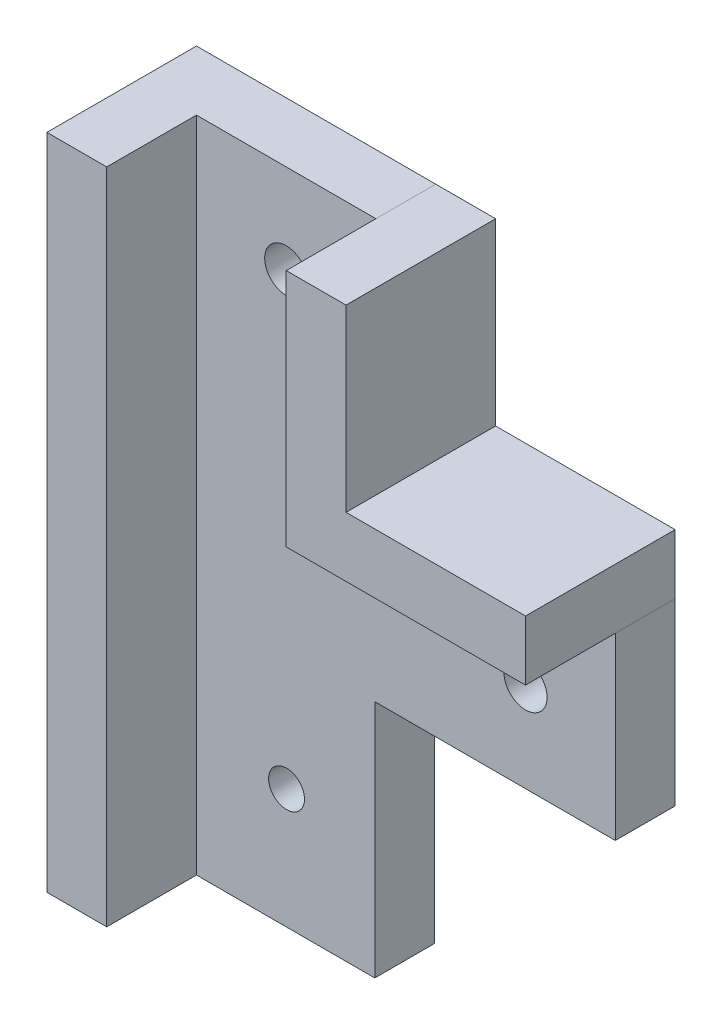
ISO-10303-21;
HEADER;
FILE_DESCRIPTION(('STEP AP214'),'2;1');
FILE_NAME('part.step','',(''),(''),'','','');
FILE_SCHEMA(('AUTOMOTIVE_DESIGN { 1 0 10303 214 1 1 1 1 }'));
ENDSEC;
DATA;
#1=APPLICATION_CONTEXT('core data for automotive mechanical design processes');
#2=APPLICATION_PROTOCOL_DEFINITION('international standard','automotive_design',2000,#1);
#3=PRODUCT_CONTEXT('',#1,'mechanical');
#4=PRODUCT('Part','Part','',(#3));
#5=PRODUCT_RELATED_PRODUCT_CATEGORY('part','',(#4));
#6=PRODUCT_DEFINITION_FORMATION('','',#4);
#7=PRODUCT_DEFINITION_CONTEXT('part definition',#1,'design');
#8=PRODUCT_DEFINITION('design','',#6,#7);
#9=PRODUCT_DEFINITION_SHAPE('','',#8);
#10=(LENGTH_UNIT() NAMED_UNIT(*) SI_UNIT(.MILLI.,.METRE.));
#11=(NAMED_UNIT(*) PLANE_ANGLE_UNIT() SI_UNIT($,.RADIAN.));
#12=(NAMED_UNIT(*) SI_UNIT($,.STERADIAN.) SOLID_ANGLE_UNIT());
#13=UNCERTAINTY_MEASURE_WITH_UNIT(LENGTH_MEASURE(1.E-05),#10,'distance_accuracy_value','');
#14=(GEOMETRIC_REPRESENTATION_CONTEXT(3) GLOBAL_UNCERTAINTY_ASSIGNED_CONTEXT((#13)) GLOBAL_UNIT_ASSIGNED_CONTEXT((#10,
#11,#12)) REPRESENTATION_CONTEXT('',''));
#15=CARTESIAN_POINT('',(0.,0.,0.));
#16=DIRECTION('',(0.,0.,1.));
#17=DIRECTION('',(1.,0.,0.));
#18=AXIS2_PLACEMENT_3D('',#15,#16,#17);
#19=CARTESIAN_POINT('',(-7.52988047808764,9.19322709163348,12.5));
#20=DIRECTION('',(0.,1.,0.));
#21=DIRECTION('',(0.,0.,1.));
#22=AXIS2_PLACEMENT_3D('',#19,#20,#21);
#23=PLANE('',#22);
#24=DIRECTION('',(1.,0.,0.));
#25=VECTOR('',#24,1.);
#26=CARTESIAN_POINT('',(-7.52988047808764,9.19322709163348,0.));
#27=LINE('',#26,#25);
#28=CARTESIAN_POINT('',(-12.5298804780876,9.19322709163348,0.));
#29=VERTEX_POINT('',#28);
#30=CARTESIAN_POINT('',(7.47011952191236,9.19322709163348,0.));
#31=VERTEX_POINT('',#30);
#32=EDGE_CURVE('E216',#29,#31,#27,.T.);
#33=ORIENTED_EDGE('',*,*,#32,.F.);
#34=DIRECTION('',(0.,0.,-1.));
#35=VECTOR('',#34,1.);
#36=CARTESIAN_POINT('',(-12.5298804780876,9.19322709163348,12.5));
#37=LINE('',#36,#35);
#38=CARTESIAN_POINT('',(-12.5298804780876,9.19322709163348,12.5));
#39=VERTEX_POINT('',#38);
#40=EDGE_CURVE('E59',#39,#29,#37,.T.);
#41=ORIENTED_EDGE('',*,*,#40,.F.);
#42=DIRECTION('',(1.,0.,0.));
#43=VECTOR('',#42,1.);
#44=CARTESIAN_POINT('',(-7.52988047808764,9.19322709163348,12.5));
#45=LINE('',#44,#43);
#46=CARTESIAN_POINT('',(-7.52988047808764,9.19322709163348,12.5));
#47=VERTEX_POINT('',#46);
#48=EDGE_CURVE('E223',#39,#47,#45,.T.);
#49=ORIENTED_EDGE('',*,*,#48,.T.);
#50=DIRECTION('',(0.,0.,-1.));
#51=VECTOR('',#50,1.);
#52=CARTESIAN_POINT('',(-7.52988047808764,9.19322709163348,12.5));
#53=LINE('',#52,#51);
#54=CARTESIAN_POINT('',(-7.52988047808764,9.19322709163348,5.));
#55=VERTEX_POINT('',#54);
#56=EDGE_CURVE('E12',#47,#55,#53,.T.);
#57=ORIENTED_EDGE('',*,*,#56,.T.);
#58=DIRECTION('',(-1.,0.,0.));
#59=VECTOR('',#58,1.);
#60=CARTESIAN_POINT('',(-7.52988047808764,9.19322709163348,5.));
#61=LINE('',#60,#59);
#62=CARTESIAN_POINT('',(7.47011952191236,9.19322709163348,5.));
#63=VERTEX_POINT('',#62);
#64=EDGE_CURVE('E168',#63,#55,#61,.T.);
#65=ORIENTED_EDGE('',*,*,#64,.F.);
#66=DIRECTION('',(0.,0.,-1.));
#67=VECTOR('',#66,1.);
#68=CARTESIAN_POINT('',(7.47011952191236,9.19322709163348,5.));
#69=LINE('',#68,#67);
#70=EDGE_CURVE('E172',#63,#31,#69,.T.);
#71=ORIENTED_EDGE('',*,*,#70,.T.);
#72=EDGE_LOOP('',(#33,#41,#49,#57,#65,#71));
#73=FACE_BOUND('',#72,.T.);
#74=ADVANCED_FACE('F49',(#73),#23,.T.);
#75=CARTESIAN_POINT('',(-12.5298804780876,-45.8067729083665,12.5));
#76=DIRECTION('',(-1.,0.,0.));
#77=DIRECTION('',(0.,0.,1.));
#78=AXIS2_PLACEMENT_3D('',#75,#76,#77);
#79=PLANE('',#78);
#80=DIRECTION('',(0.,1.,0.));
#81=VECTOR('',#80,1.);
#82=CARTESIAN_POINT('',(-12.5298804780876,-45.8067729083665,0.));
#83=LINE('',#82,#81);
#84=CARTESIAN_POINT('',(-12.5298804780876,-45.8067729083665,0.));
#85=VERTEX_POINT('',#84);
#86=EDGE_CURVE('E230',#85,#29,#83,.T.);
#87=ORIENTED_EDGE('',*,*,#86,.F.);
#88=DIRECTION('',(0.,0.,-1.));
#89=VECTOR('',#88,1.);
#90=CARTESIAN_POINT('',(-12.5298804780876,-45.8067729083665,12.5));
#91=LINE('',#90,#89);
#92=CARTESIAN_POINT('',(-12.5298804780876,-45.8067729083665,12.5));
#93=VERTEX_POINT('',#92);
#94=EDGE_CURVE('E236',#93,#85,#91,.T.);
#95=ORIENTED_EDGE('',*,*,#94,.F.);
#96=DIRECTION('',(0.,1.,0.));
#97=VECTOR('',#96,1.);
#98=CARTESIAN_POINT('',(-12.5298804780876,-45.8067729083665,12.5));
#99=LINE('',#98,#97);
#100=EDGE_CURVE('E220',#93,#39,#99,.T.);
#101=ORIENTED_EDGE('',*,*,#100,.T.);
#102=ORIENTED_EDGE('',*,*,#40,.T.);
#103=EDGE_LOOP('',(#87,#95,#101,#102));
#104=FACE_BOUND('',#103,.T.);
#105=ADVANCED_FACE('F244',(#104),#79,.T.);
#106=CARTESIAN_POINT('',(-7.52988047808764,-45.8067729083665,12.5));
#107=DIRECTION('',(0.,-1.,0.));
#108=DIRECTION('',(0.,0.,-1.));
#109=AXIS2_PLACEMENT_3D('',#106,#107,#108);
#110=PLANE('',#109);
#111=DIRECTION('',(-1.,0.,0.));
#112=VECTOR('',#111,1.);
#113=CARTESIAN_POINT('',(-7.52988047808764,-45.8067729083665,0.));
#114=LINE('',#113,#112);
#115=CARTESIAN_POINT('',(7.37011952191236,-45.8067729083665,0.));
#116=VERTEX_POINT('',#115);
#117=EDGE_CURVE('E210',#116,#85,#114,.T.);
#118=ORIENTED_EDGE('',*,*,#117,.F.);
#119=DIRECTION('',(0.,0.,1.));
#120=VECTOR('',#119,1.);
#121=CARTESIAN_POINT('',(7.37011952191236,-45.8067729083665,0.));
#122=LINE('',#121,#120);
#123=CARTESIAN_POINT('',(7.37011952191236,-45.8067729083665,5.));
#124=VERTEX_POINT('',#123);
#125=EDGE_CURVE('E198',#116,#124,#122,.T.);
#126=ORIENTED_EDGE('',*,*,#125,.T.);
#127=DIRECTION('',(1.,0.,0.));
#128=VECTOR('',#127,1.);
#129=CARTESIAN_POINT('',(-7.52988047808764,-45.8067729083665,5.));
#130=LINE('',#129,#128);
#131=CARTESIAN_POINT('',(-7.52988047808764,-45.8067729083665,5.));
#132=VERTEX_POINT('',#131);
#133=EDGE_CURVE('E202',#132,#124,#130,.T.);
#134=ORIENTED_EDGE('',*,*,#133,.F.);
#135=DIRECTION('',(0.,0.,-1.));
#136=VECTOR('',#135,1.);
#137=CARTESIAN_POINT('',(-7.52988047808764,-45.8067729083665,12.5));
#138=LINE('',#137,#136);
#139=CARTESIAN_POINT('',(-7.52988047808764,-45.8067729083665,12.5));
#140=VERTEX_POINT('',#139);
#141=EDGE_CURVE('E53',#140,#132,#138,.T.);
#142=ORIENTED_EDGE('',*,*,#141,.F.);
#143=DIRECTION('',(-1.,0.,0.));
#144=VECTOR('',#143,1.);
#145=CARTESIAN_POINT('',(-7.52988047808764,-45.8067729083665,12.5));
#146=LINE('',#145,#144);
#147=EDGE_CURVE('E215',#140,#93,#146,.T.);
#148=ORIENTED_EDGE('',*,*,#147,.T.);
#149=ORIENTED_EDGE('',*,*,#94,.T.);
#150=EDGE_LOOP('',(#118,#126,#134,#142,#148,#149));
#151=FACE_BOUND('',#150,.T.);
#152=ADVANCED_FACE('F240',(#151),#110,.T.);
#153=CARTESIAN_POINT('',(-7.52988047808764,-25.8067729083665,12.5));
#154=DIRECTION('',(1.,0.,0.));
#155=DIRECTION('',(0.,0.,-1.));
#156=AXIS2_PLACEMENT_3D('',#153,#154,#155);
#157=PLANE('',#156);
#158=DIRECTION('',(0.,-1.,0.));
#159=VECTOR('',#158,1.);
#160=CARTESIAN_POINT('',(-7.52988047808764,-25.8067729083665,5.));
#161=LINE('',#160,#159);
#162=EDGE_CURVE('E152',#55,#132,#161,.T.);
#163=ORIENTED_EDGE('',*,*,#162,.F.);
#164=ORIENTED_EDGE('',*,*,#56,.F.);
#165=DIRECTION('',(0.,-1.,0.));
#166=VECTOR('',#165,1.);
#167=CARTESIAN_POINT('',(-7.52988047808764,-25.8067729083665,12.5));
#168=LINE('',#167,#166);
#169=EDGE_CURVE('E88',#47,#140,#168,.T.);
#170=ORIENTED_EDGE('',*,*,#169,.T.);
#171=ORIENTED_EDGE('',*,*,#141,.T.);
#172=EDGE_LOOP('',(#163,#164,#170,#171));
#173=FACE_BOUND('',#172,.T.);
#174=ADVANCED_FACE('F51',(#173),#157,.T.);
#175=CARTESIAN_POINT('',(0.,0.,12.5));
#176=DIRECTION('',(0.,0.,1.));
#177=DIRECTION('',(1.,0.,0.));
#178=AXIS2_PLACEMENT_3D('',#175,#176,#177);
#179=PLANE('',#178);
#180=ORIENTED_EDGE('',*,*,#169,.F.);
#181=ORIENTED_EDGE('',*,*,#48,.F.);
#182=ORIENTED_EDGE('',*,*,#100,.F.);
#183=ORIENTED_EDGE('',*,*,#147,.F.);
#184=EDGE_LOOP('',(#180,#181,#182,#183));
#185=FACE_BOUND('',#184,.T.);
#186=ADVANCED_FACE('F254',(#185),#179,.T.);
#187=CARTESIAN_POINT('',(0.,0.,0.));
#188=DIRECTION('',(0.,0.,1.));
#189=DIRECTION('',(1.,0.,0.));
#190=AXIS2_PLACEMENT_3D('',#187,#188,#189);
#191=PLANE('',#190);
#192=CARTESIAN_POINT('',(0.,-35.8067729083665,0.));
#193=DIRECTION('',(0.,0.,1.));
#194=DIRECTION('',(1.,0.,0.));
#195=AXIS2_PLACEMENT_3D('',#192,#193,#194);
#196=CIRCLE('',#195,1.5);
#197=CARTESIAN_POINT('',(1.5,-35.8067729083665,0.));
#198=VERTEX_POINT('',#197);
#199=EDGE_CURVE('E305',#198,#198,#196,.T.);
#200=ORIENTED_EDGE('',*,*,#199,.T.);
#201=EDGE_LOOP('',(#200));
#202=FACE_BOUND('',#201,.T.);
#203=ORIENTED_EDGE('',*,*,#32,.T.);
#204=DIRECTION('',(0.,1.,0.));
#205=VECTOR('',#204,1.);
#206=CARTESIAN_POINT('',(7.47011952191236,9.19322709163348,0.));
#207=LINE('',#206,#205);
#208=CARTESIAN_POINT('',(7.47011952191236,-10.8067729083665,0.));
#209=VERTEX_POINT('',#208);
#210=EDGE_CURVE('E142',#209,#31,#207,.T.);
#211=ORIENTED_EDGE('',*,*,#210,.F.);
#212=DIRECTION('',(-1.,0.,0.));
#213=VECTOR('',#212,1.);
#214=CARTESIAN_POINT('',(27.4701195219124,-10.8067729083665,0.));
#215=LINE('',#214,#213);
#216=CARTESIAN_POINT('',(27.4701195219124,-10.8067729083665,0.));
#217=VERTEX_POINT('',#216);
#218=EDGE_CURVE('E179',#217,#209,#215,.T.);
#219=ORIENTED_EDGE('',*,*,#218,.F.);
#220=DIRECTION('',(0.,1.,0.));
#221=VECTOR('',#220,1.);
#222=CARTESIAN_POINT('',(27.4701195219124,-25.8067729083665,0.));
#223=LINE('',#222,#221);
#224=CARTESIAN_POINT('',(27.4701195219124,-25.8067729083665,0.));
#225=VERTEX_POINT('',#224);
#226=EDGE_CURVE('E175',#225,#217,#223,.T.);
#227=ORIENTED_EDGE('',*,*,#226,.F.);
#228=DIRECTION('',(1.,0.,0.));
#229=VECTOR('',#228,1.);
#230=CARTESIAN_POINT('',(7.37011952191236,-25.8067729083665,0.));
#231=LINE('',#230,#229);
#232=CARTESIAN_POINT('',(7.37011952191236,-25.8067729083665,0.));
#233=VERTEX_POINT('',#232);
#234=EDGE_CURVE('E148',#233,#225,#231,.T.);
#235=ORIENTED_EDGE('',*,*,#234,.F.);
#236=DIRECTION('',(0.,1.,0.));
#237=VECTOR('',#236,1.);
#238=CARTESIAN_POINT('',(7.37011952191236,-45.8067729083665,0.));
#239=LINE('',#238,#237);
#240=EDGE_CURVE('E194',#116,#233,#239,.T.);
#241=ORIENTED_EDGE('',*,*,#240,.F.);
#242=ORIENTED_EDGE('',*,*,#117,.T.);
#243=ORIENTED_EDGE('',*,*,#86,.T.);
#244=EDGE_LOOP('',(#203,#211,#219,#227,#235,#241,#242,#243));
#245=FACE_BOUND('',#244,.T.);
#246=CARTESIAN_POINT('',(-0.0298804780876419,1.69322709163348,0.));
#247=DIRECTION('',(0.,0.,-1.));
#248=DIRECTION('',(-1.,0.,0.));
#249=AXIS2_PLACEMENT_3D('',#246,#247,#248);
#250=CIRCLE('',#249,1.8);
#251=CARTESIAN_POINT('',(-1.82988047808764,1.69322709163348,0.));
#252=VERTEX_POINT('',#251);
#253=EDGE_CURVE('E315',#252,#252,#250,.T.);
#254=ORIENTED_EDGE('',*,*,#253,.F.);
#255=EDGE_LOOP('',(#254));
#256=FACE_BOUND('',#255,.T.);
#257=CARTESIAN_POINT('',(19.9701195219124,-18.3067729083665,0.));
#258=DIRECTION('',(0.,0.,-1.));
#259=DIRECTION('',(-1.,0.,0.));
#260=AXIS2_PLACEMENT_3D('',#257,#258,#259);
#261=CIRCLE('',#260,1.8);
#262=CARTESIAN_POINT('',(18.1701195219124,-18.3067729083665,0.));
#263=VERTEX_POINT('',#262);
#264=EDGE_CURVE('E312',#263,#263,#261,.T.);
#265=ORIENTED_EDGE('',*,*,#264,.F.);
#266=EDGE_LOOP('',(#265));
#267=FACE_BOUND('',#266,.T.);
#268=ADVANCED_FACE('F248',(#202,#245,#256,#267),#191,.F.);
#269=CARTESIAN_POINT('',(7.37011952191236,-45.8067729083665,0.));
#270=DIRECTION('',(1.,0.,0.));
#271=DIRECTION('',(0.,1.,0.));
#272=AXIS2_PLACEMENT_3D('',#269,#270,#271);
#273=PLANE('',#272);
#274=DIRECTION('',(0.,1.,0.));
#275=VECTOR('',#274,1.);
#276=CARTESIAN_POINT('',(7.37011952191236,-45.8067729083665,5.));
#277=LINE('',#276,#275);
#278=CARTESIAN_POINT('',(7.37011952191236,-25.8067729083665,5.));
#279=VERTEX_POINT('',#278);
#280=EDGE_CURVE('E138',#124,#279,#277,.T.);
#281=ORIENTED_EDGE('',*,*,#280,.F.);
#282=ORIENTED_EDGE('',*,*,#125,.F.);
#283=ORIENTED_EDGE('',*,*,#240,.T.);
#284=DIRECTION('',(0.,0.,1.));
#285=VECTOR('',#284,1.);
#286=CARTESIAN_POINT('',(7.37011952191236,-25.8067729083665,0.));
#287=LINE('',#286,#285);
#288=EDGE_CURVE('E207',#233,#279,#287,.T.);
#289=ORIENTED_EDGE('',*,*,#288,.T.);
#290=EDGE_LOOP('',(#281,#282,#283,#289));
#291=FACE_BOUND('',#290,.T.);
#292=ADVANCED_FACE('F251',(#291),#273,.T.);
#293=CARTESIAN_POINT('',(0.,0.,5.));
#294=DIRECTION('',(0.,0.,1.));
#295=DIRECTION('',(1.,0.,0.));
#296=AXIS2_PLACEMENT_3D('',#293,#294,#295);
#297=PLANE('',#296);
#298=CARTESIAN_POINT('',(0.,-35.8067729083665,5.));
#299=DIRECTION('',(0.,0.,1.));
#300=DIRECTION('',(1.,0.,0.));
#301=AXIS2_PLACEMENT_3D('',#298,#299,#300);
#302=CIRCLE('',#301,1.5);
#303=CARTESIAN_POINT('',(1.5,-35.8067729083665,5.));
#304=VERTEX_POINT('',#303);
#305=EDGE_CURVE('E308',#304,#304,#302,.T.);
#306=ORIENTED_EDGE('',*,*,#305,.F.);
#307=EDGE_LOOP('',(#306));
#308=FACE_BOUND('',#307,.T.);
#309=ORIENTED_EDGE('',*,*,#280,.T.);
#310=DIRECTION('',(1.,0.,0.));
#311=VECTOR('',#310,1.);
#312=CARTESIAN_POINT('',(-7.52988047808764,-25.8067729083665,5.));
#313=LINE('',#312,#311);
#314=CARTESIAN_POINT('',(27.4701195219124,-25.8067729083665,5.));
#315=VERTEX_POINT('',#314);
#316=EDGE_CURVE('E129',#279,#315,#313,.T.);
#317=ORIENTED_EDGE('',*,*,#316,.T.);
#318=DIRECTION('',(0.,1.,0.));
#319=VECTOR('',#318,1.);
#320=CARTESIAN_POINT('',(27.4701195219124,-25.8067729083665,5.));
#321=LINE('',#320,#319);
#322=CARTESIAN_POINT('',(27.4701195219124,-10.8067729083665,5.));
#323=VERTEX_POINT('',#322);
#324=EDGE_CURVE('E134',#315,#323,#321,.T.);
#325=ORIENTED_EDGE('',*,*,#324,.T.);
#326=DIRECTION('',(-1.,0.,0.));
#327=VECTOR('',#326,1.);
#328=CARTESIAN_POINT('',(27.4701195219124,-10.8067729083665,5.));
#329=LINE('',#328,#327);
#330=CARTESIAN_POINT('',(7.47011952191236,-10.8067729083665,5.));
#331=VERTEX_POINT('',#330);
#332=EDGE_CURVE('E159',#323,#331,#329,.T.);
#333=ORIENTED_EDGE('',*,*,#332,.T.);
#334=DIRECTION('',(0.,1.,0.));
#335=VECTOR('',#334,1.);
#336=CARTESIAN_POINT('',(7.47011952191236,9.19322709163348,5.));
#337=LINE('',#336,#335);
#338=EDGE_CURVE('E162',#331,#63,#337,.T.);
#339=ORIENTED_EDGE('',*,*,#338,.T.);
#340=ORIENTED_EDGE('',*,*,#64,.T.);
#341=ORIENTED_EDGE('',*,*,#162,.T.);
#342=ORIENTED_EDGE('',*,*,#133,.T.);
#343=EDGE_LOOP('',(#309,#317,#325,#333,#339,#340,#341,#342));
#344=FACE_BOUND('',#343,.T.);
#345=CARTESIAN_POINT('',(-0.0298804780876419,1.69322709163348,5.));
#346=DIRECTION('',(0.,0.,1.));
#347=DIRECTION('',(1.,0.,0.));
#348=AXIS2_PLACEMENT_3D('',#345,#346,#347);
#349=CIRCLE('',#348,1.8);
#350=CARTESIAN_POINT('',(1.77011952191236,1.69322709163348,5.));
#351=VERTEX_POINT('',#350);
#352=EDGE_CURVE('E176',#351,#351,#349,.T.);
#353=ORIENTED_EDGE('',*,*,#352,.F.);
#354=EDGE_LOOP('',(#353));
#355=FACE_BOUND('',#354,.T.);
#356=CARTESIAN_POINT('',(19.9701195219124,-18.3067729083665,5.));
#357=DIRECTION('',(0.,0.,1.));
#358=DIRECTION('',(1.,0.,0.));
#359=AXIS2_PLACEMENT_3D('',#356,#357,#358);
#360=CIRCLE('',#359,1.8);
#361=CARTESIAN_POINT('',(21.7701195219124,-18.3067729083665,5.));
#362=VERTEX_POINT('',#361);
#363=EDGE_CURVE('E319',#362,#362,#360,.T.);
#364=ORIENTED_EDGE('',*,*,#363,.F.);
#365=EDGE_LOOP('',(#364));
#366=FACE_BOUND('',#365,.T.);
#367=ADVANCED_FACE('F131',(#308,#344,#355,#366),#297,.T.);
#368=CARTESIAN_POINT('',(7.37011952191236,-25.8067729083665,5.));
#369=DIRECTION('',(0.,1.,0.));
#370=DIRECTION('',(0.,0.,1.));
#371=AXIS2_PLACEMENT_3D('',#368,#369,#370);
#372=PLANE('',#371);
#373=ORIENTED_EDGE('',*,*,#288,.F.);
#374=ORIENTED_EDGE('',*,*,#234,.T.);
#375=DIRECTION('',(0.,0.,-1.));
#376=VECTOR('',#375,1.);
#377=CARTESIAN_POINT('',(27.4701195219124,-25.8067729083665,5.));
#378=LINE('',#377,#376);
#379=EDGE_CURVE('E145',#315,#225,#378,.T.);
#380=ORIENTED_EDGE('',*,*,#379,.F.);
#381=ORIENTED_EDGE('',*,*,#316,.F.);
#382=EDGE_LOOP('',(#373,#374,#380,#381));
#383=FACE_BOUND('',#382,.T.);
#384=ADVANCED_FACE('F146',(#383),#372,.F.);
#385=CARTESIAN_POINT('',(27.4701195219124,-25.8067729083665,5.));
#386=DIRECTION('',(-1.,0.,0.));
#387=DIRECTION('',(0.,0.,1.));
#388=AXIS2_PLACEMENT_3D('',#385,#386,#387);
#389=PLANE('',#388);
#390=ORIENTED_EDGE('',*,*,#226,.T.);
#391=DIRECTION('',(0.,0.,-1.));
#392=VECTOR('',#391,1.);
#393=CARTESIAN_POINT('',(27.4701195219124,-10.8067729083665,5.));
#394=LINE('',#393,#392);
#395=EDGE_CURVE('E153',#323,#217,#394,.T.);
#396=ORIENTED_EDGE('',*,*,#395,.F.);
#397=ORIENTED_EDGE('',*,*,#324,.F.);
#398=ORIENTED_EDGE('',*,*,#379,.T.);
#399=EDGE_LOOP('',(#390,#396,#397,#398));
#400=FACE_BOUND('',#399,.T.);
#401=ADVANCED_FACE('F155',(#400),#389,.F.);
#402=CARTESIAN_POINT('',(27.4701195219124,-10.8067729083665,5.));
#403=DIRECTION('',(0.,-1.,0.));
#404=DIRECTION('',(1.,0.,0.));
#405=AXIS2_PLACEMENT_3D('',#402,#403,#404);
#406=PLANE('',#405);
#407=ORIENTED_EDGE('',*,*,#218,.T.);
#408=DIRECTION('',(0.,0.,-1.));
#409=VECTOR('',#408,1.);
#410=CARTESIAN_POINT('',(7.47011952191236,-10.8067729083665,5.));
#411=LINE('',#410,#409);
#412=EDGE_CURVE('E188',#331,#209,#411,.T.);
#413=ORIENTED_EDGE('',*,*,#412,.F.);
#414=ORIENTED_EDGE('',*,*,#332,.F.);
#415=ORIENTED_EDGE('',*,*,#395,.T.);
#416=EDGE_LOOP('',(#407,#413,#414,#415));
#417=FACE_BOUND('',#416,.T.);
#418=ADVANCED_FACE('F281',(#417),#406,.F.);
#419=CARTESIAN_POINT('',(7.47011952191236,9.19322709163348,5.));
#420=DIRECTION('',(-1.,0.,0.));
#421=DIRECTION('',(0.,-1.,0.));
#422=AXIS2_PLACEMENT_3D('',#419,#420,#421);
#423=PLANE('',#422);
#424=ORIENTED_EDGE('',*,*,#210,.T.);
#425=ORIENTED_EDGE('',*,*,#70,.F.);
#426=ORIENTED_EDGE('',*,*,#338,.F.);
#427=ORIENTED_EDGE('',*,*,#412,.T.);
#428=EDGE_LOOP('',(#424,#425,#426,#427));
#429=FACE_BOUND('',#428,.T.);
#430=ADVANCED_FACE('F284',(#429),#423,.F.);
#431=CARTESIAN_POINT('',(19.9701195219124,-18.3067729083665,12.5));
#432=DIRECTION('',(0.,0.,-1.));
#433=DIRECTION('',(-1.,0.,0.));
#434=AXIS2_PLACEMENT_3D('',#431,#432,#433);
#435=CYLINDRICAL_SURFACE('',#434,1.8);
#436=ORIENTED_EDGE('',*,*,#363,.T.);
#437=EDGE_LOOP('',(#436));
#438=FACE_BOUND('',#437,.T.);
#439=ORIENTED_EDGE('',*,*,#264,.T.);
#440=EDGE_LOOP('',(#439));
#441=FACE_BOUND('',#440,.T.);
#442=ADVANCED_FACE('F288',(#438,#441),#435,.F.);
#443=CARTESIAN_POINT('',(-0.0298804780876419,1.69322709163348,12.5));
#444=DIRECTION('',(0.,0.,-1.));
#445=DIRECTION('',(-1.,0.,0.));
#446=AXIS2_PLACEMENT_3D('',#443,#444,#445);
#447=CYLINDRICAL_SURFACE('',#446,1.8);
#448=ORIENTED_EDGE('',*,*,#352,.T.);
#449=EDGE_LOOP('',(#448));
#450=FACE_BOUND('',#449,.T.);
#451=ORIENTED_EDGE('',*,*,#253,.T.);
#452=EDGE_LOOP('',(#451));
#453=FACE_BOUND('',#452,.T.);
#454=ADVANCED_FACE('F292',(#450,#453),#447,.F.);
#455=CARTESIAN_POINT('',(0.,-35.8067729083665,0.));
#456=DIRECTION('',(0.,0.,1.));
#457=DIRECTION('',(1.,0.,0.));
#458=AXIS2_PLACEMENT_3D('',#455,#456,#457);
#459=CYLINDRICAL_SURFACE('',#458,1.5);
#460=ORIENTED_EDGE('',*,*,#199,.F.);
#461=EDGE_LOOP('',(#460));
#462=FACE_BOUND('',#461,.T.);
#463=ORIENTED_EDGE('',*,*,#305,.T.);
#464=EDGE_LOOP('',(#463));
#465=FACE_BOUND('',#464,.T.);
#466=ADVANCED_FACE('F296',(#462,#465),#459,.F.);
#467=CLOSED_SHELL('',(#74,#105,#152,#174,#186,#268,#292,#367,#384,#401,#418,#430,#442,#454,#466));
#468=MANIFOLD_SOLID_BREP('B2',#467);
#469=CARTESIAN_POINT('',(7.47011952191236,-10.8067729083665,12.5));
#470=DIRECTION('',(-1.,0.,0.));
#471=DIRECTION('',(0.,-1.,0.));
#472=AXIS2_PLACEMENT_3D('',#469,#470,#471);
#473=PLANE('',#472);
#474=DIRECTION('',(0.,1.,0.));
#475=VECTOR('',#474,1.);
#476=CARTESIAN_POINT('',(7.47011952191236,-10.8067729083665,0.));
#477=LINE('',#476,#475);
#478=CARTESIAN_POINT('',(7.47011952191236,-10.8067729083665,0.));
#479=VERTEX_POINT('',#478);
#480=CARTESIAN_POINT('',(7.47011952191236,9.19322709163348,0.));
#481=VERTEX_POINT('',#480);
#482=EDGE_CURVE('E534',#479,#481,#477,.T.);
#483=ORIENTED_EDGE('',*,*,#482,.F.);
#484=DIRECTION('',(0.,0.,-1.));
#485=VECTOR('',#484,1.);
#486=CARTESIAN_POINT('',(7.47011952191236,-10.8067729083665,12.5));
#487=LINE('',#486,#485);
#488=CARTESIAN_POINT('',(7.47011952191236,-10.8067729083665,12.5));
#489=VERTEX_POINT('',#488);
#490=EDGE_CURVE('E47',#489,#479,#487,.T.);
#491=ORIENTED_EDGE('',*,*,#490,.F.);
#492=DIRECTION('',(0.,1.,0.));
#493=VECTOR('',#492,1.);
#494=CARTESIAN_POINT('',(7.47011952191236,-10.8067729083665,12.5));
#495=LINE('',#494,#493);
#496=CARTESIAN_POINT('',(7.47011952191236,9.19322709163348,12.5));
#497=VERTEX_POINT('',#496);
#498=EDGE_CURVE('E548',#489,#497,#495,.T.);
#499=ORIENTED_EDGE('',*,*,#498,.T.);
#500=DIRECTION('',(0.,0.,-1.));
#501=VECTOR('',#500,1.);
#502=CARTESIAN_POINT('',(7.47011952191236,9.19322709163348,12.5));
#503=LINE('',#502,#501);
#504=EDGE_CURVE('E452',#497,#481,#503,.T.);
#505=ORIENTED_EDGE('',*,*,#504,.T.);
#506=EDGE_LOOP('',(#483,#491,#499,#505));
#507=FACE_BOUND('',#506,.T.);
#508=ADVANCED_FACE('F449',(#507),#473,.T.);
#509=CARTESIAN_POINT('',(27.4701195219124,-10.8067729083665,12.5));
#510=DIRECTION('',(0.,-1.,0.));
#511=DIRECTION('',(1.,0.,0.));
#512=AXIS2_PLACEMENT_3D('',#509,#510,#511);
#513=PLANE('',#512);
#514=DIRECTION('',(-1.,0.,0.));
#515=VECTOR('',#514,1.);
#516=CARTESIAN_POINT('',(27.4701195219124,-10.8067729083665,0.));
#517=LINE('',#516,#515);
#518=CARTESIAN_POINT('',(27.4701195219124,-10.8067729083665,0.));
#519=VERTEX_POINT('',#518);
#520=EDGE_CURVE('E546',#519,#479,#517,.T.);
#521=ORIENTED_EDGE('',*,*,#520,.F.);
#522=DIRECTION('',(0.,0.,-1.));
#523=VECTOR('',#522,1.);
#524=CARTESIAN_POINT('',(27.4701195219124,-10.8067729083665,12.5));
#525=LINE('',#524,#523);
#526=CARTESIAN_POINT('',(27.4701195219124,-10.8067729083665,12.5));
#527=VERTEX_POINT('',#526);
#528=EDGE_CURVE('E458',#527,#519,#525,.T.);
#529=ORIENTED_EDGE('',*,*,#528,.F.);
#530=DIRECTION('',(-1.,0.,0.));
#531=VECTOR('',#530,1.);
#532=CARTESIAN_POINT('',(27.4701195219124,-10.8067729083665,12.5));
#533=LINE('',#532,#531);
#534=EDGE_CURVE('E524',#527,#489,#533,.T.);
#535=ORIENTED_EDGE('',*,*,#534,.T.);
#536=ORIENTED_EDGE('',*,*,#490,.T.);
#537=EDGE_LOOP('',(#521,#529,#535,#536));
#538=FACE_BOUND('',#537,.T.);
#539=ADVANCED_FACE('F556',(#538),#513,.T.);
#540=CARTESIAN_POINT('',(27.4701195219124,-10.8067729083665,12.5));
#541=DIRECTION('',(1.,0.,0.));
#542=DIRECTION('',(0.,0.,-1.));
#543=AXIS2_PLACEMENT_3D('',#540,#541,#542);
#544=PLANE('',#543);
#545=DIRECTION('',(0.,-1.,0.));
#546=VECTOR('',#545,1.);
#547=CARTESIAN_POINT('',(27.4701195219124,-10.8067729083665,0.));
#548=LINE('',#547,#546);
#549=CARTESIAN_POINT('',(27.4701195219124,-5.80677290836653,0.));
#550=VERTEX_POINT('',#549);
#551=EDGE_CURVE('E511',#550,#519,#548,.T.);
#552=ORIENTED_EDGE('',*,*,#551,.F.);
#553=DIRECTION('',(0.,0.,-1.));
#554=VECTOR('',#553,1.);
#555=CARTESIAN_POINT('',(27.4701195219124,-5.80677290836653,12.5));
#556=LINE('',#555,#554);
#557=CARTESIAN_POINT('',(27.4701195219124,-5.80677290836653,12.5));
#558=VERTEX_POINT('',#557);
#559=EDGE_CURVE('E506',#558,#550,#556,.T.);
#560=ORIENTED_EDGE('',*,*,#559,.F.);
#561=DIRECTION('',(0.,-1.,0.));
#562=VECTOR('',#561,1.);
#563=CARTESIAN_POINT('',(27.4701195219124,-10.8067729083665,12.5));
#564=LINE('',#563,#562);
#565=EDGE_CURVE('E509',#558,#527,#564,.T.);
#566=ORIENTED_EDGE('',*,*,#565,.T.);
#567=ORIENTED_EDGE('',*,*,#528,.T.);
#568=EDGE_LOOP('',(#552,#560,#566,#567));
#569=FACE_BOUND('',#568,.T.);
#570=ADVANCED_FACE('F508',(#569),#544,.T.);
#571=CARTESIAN_POINT('',(12.4701195219124,-5.80677290836653,12.5));
#572=DIRECTION('',(0.,1.,0.));
#573=DIRECTION('',(-1.,0.,0.));
#574=AXIS2_PLACEMENT_3D('',#571,#572,#573);
#575=PLANE('',#574);
#576=DIRECTION('',(1.,0.,0.));
#577=VECTOR('',#576,1.);
#578=CARTESIAN_POINT('',(12.4701195219124,-5.80677290836653,0.));
#579=LINE('',#578,#577);
#580=CARTESIAN_POINT('',(12.4701195219124,-5.80677290836653,0.));
#581=VERTEX_POINT('',#580);
#582=EDGE_CURVE('E543',#581,#550,#579,.T.);
#583=ORIENTED_EDGE('',*,*,#582,.F.);
#584=DIRECTION('',(0.,0.,-1.));
#585=VECTOR('',#584,1.);
#586=CARTESIAN_POINT('',(12.4701195219124,-5.80677290836653,12.5));
#587=LINE('',#586,#585);
#588=CARTESIAN_POINT('',(12.4701195219124,-5.80677290836653,12.5));
#589=VERTEX_POINT('',#588);
#590=EDGE_CURVE('E516',#589,#581,#587,.T.);
#591=ORIENTED_EDGE('',*,*,#590,.F.);
#592=DIRECTION('',(1.,0.,0.));
#593=VECTOR('',#592,1.);
#594=CARTESIAN_POINT('',(12.4701195219124,-5.80677290836653,12.5));
#595=LINE('',#594,#593);
#596=EDGE_CURVE('E522',#589,#558,#595,.T.);
#597=ORIENTED_EDGE('',*,*,#596,.T.);
#598=ORIENTED_EDGE('',*,*,#559,.T.);
#599=EDGE_LOOP('',(#583,#591,#597,#598));
#600=FACE_BOUND('',#599,.T.);
#601=ADVANCED_FACE('F526',(#600),#575,.T.);
#602=CARTESIAN_POINT('',(12.4701195219124,9.19322709163348,12.5));
#603=DIRECTION('',(1.,0.,0.));
#604=DIRECTION('',(0.,1.,0.));
#605=AXIS2_PLACEMENT_3D('',#602,#603,#604);
#606=PLANE('',#605);
#607=DIRECTION('',(0.,-1.,0.));
#608=VECTOR('',#607,1.);
#609=CARTESIAN_POINT('',(12.4701195219124,9.19322709163348,0.));
#610=LINE('',#609,#608);
#611=CARTESIAN_POINT('',(12.4701195219124,9.19322709163348,0.));
#612=VERTEX_POINT('',#611);
#613=EDGE_CURVE('E540',#612,#581,#610,.T.);
#614=ORIENTED_EDGE('',*,*,#613,.F.);
#615=DIRECTION('',(0.,0.,-1.));
#616=VECTOR('',#615,1.);
#617=CARTESIAN_POINT('',(12.4701195219124,9.19322709163348,12.5));
#618=LINE('',#617,#616);
#619=CARTESIAN_POINT('',(12.4701195219124,9.19322709163348,12.5));
#620=VERTEX_POINT('',#619);
#621=EDGE_CURVE('E551',#620,#612,#618,.T.);
#622=ORIENTED_EDGE('',*,*,#621,.F.);
#623=DIRECTION('',(0.,-1.,0.));
#624=VECTOR('',#623,1.);
#625=CARTESIAN_POINT('',(12.4701195219124,9.19322709163348,12.5));
#626=LINE('',#625,#624);
#627=EDGE_CURVE('E527',#620,#589,#626,.T.);
#628=ORIENTED_EDGE('',*,*,#627,.T.);
#629=ORIENTED_EDGE('',*,*,#590,.T.);
#630=EDGE_LOOP('',(#614,#622,#628,#629));
#631=FACE_BOUND('',#630,.T.);
#632=ADVANCED_FACE('F569',(#631),#606,.T.);
#633=CARTESIAN_POINT('',(7.47011952191236,9.19322709163348,12.5));
#634=DIRECTION('',(0.,1.,0.));
#635=DIRECTION('',(0.,0.,1.));
#636=AXIS2_PLACEMENT_3D('',#633,#634,#635);
#637=PLANE('',#636);
#638=DIRECTION('',(1.,0.,0.));
#639=VECTOR('',#638,1.);
#640=CARTESIAN_POINT('',(7.47011952191236,9.19322709163348,0.));
#641=LINE('',#640,#639);
#642=EDGE_CURVE('E537',#481,#612,#641,.T.);
#643=ORIENTED_EDGE('',*,*,#642,.F.);
#644=ORIENTED_EDGE('',*,*,#504,.F.);
#645=DIRECTION('',(1.,0.,0.));
#646=VECTOR('',#645,1.);
#647=CARTESIAN_POINT('',(7.47011952191236,9.19322709163348,12.5));
#648=LINE('',#647,#646);
#649=EDGE_CURVE('E529',#497,#620,#648,.T.);
#650=ORIENTED_EDGE('',*,*,#649,.T.);
#651=ORIENTED_EDGE('',*,*,#621,.T.);
#652=EDGE_LOOP('',(#643,#644,#650,#651));
#653=FACE_BOUND('',#652,.T.);
#654=ADVANCED_FACE('F553',(#653),#637,.T.);
#655=CARTESIAN_POINT('',(0.,0.,12.5));
#656=DIRECTION('',(0.,0.,-1.));
#657=DIRECTION('',(-1.,0.,0.));
#658=AXIS2_PLACEMENT_3D('',#655,#656,#657);
#659=PLANE('',#658);
#660=ORIENTED_EDGE('',*,*,#498,.F.);
#661=ORIENTED_EDGE('',*,*,#534,.F.);
#662=ORIENTED_EDGE('',*,*,#565,.F.);
#663=ORIENTED_EDGE('',*,*,#596,.F.);
#664=ORIENTED_EDGE('',*,*,#627,.F.);
#665=ORIENTED_EDGE('',*,*,#649,.F.);
#666=EDGE_LOOP('',(#660,#661,#662,#663,#664,#665));
#667=FACE_BOUND('',#666,.T.);
#668=ADVANCED_FACE('F520',(#667),#659,.F.);
#669=CARTESIAN_POINT('',(0.,0.,0.));
#670=DIRECTION('',(0.,0.,-1.));
#671=DIRECTION('',(-1.,0.,0.));
#672=AXIS2_PLACEMENT_3D('',#669,#670,#671);
#673=PLANE('',#672);
#674=ORIENTED_EDGE('',*,*,#482,.T.);
#675=ORIENTED_EDGE('',*,*,#642,.T.);
#676=ORIENTED_EDGE('',*,*,#613,.T.);
#677=ORIENTED_EDGE('',*,*,#582,.T.);
#678=ORIENTED_EDGE('',*,*,#551,.T.);
#679=ORIENTED_EDGE('',*,*,#520,.T.);
#680=EDGE_LOOP('',(#674,#675,#676,#677,#678,#679));
#681=FACE_BOUND('',#680,.T.);
#682=ADVANCED_FACE('F555',(#681),#673,.T.);
#683=CLOSED_SHELL('',(#508,#539,#570,#601,#632,#654,#668,#682));
#684=MANIFOLD_SOLID_BREP('B6',#683);
#685=ADVANCED_BREP_SHAPE_REPRESENTATION('',(#18,#468,#684),#14);
#686=SHAPE_DEFINITION_REPRESENTATION(#9,#685);
ENDSEC;
END-ISO-10303-21;
